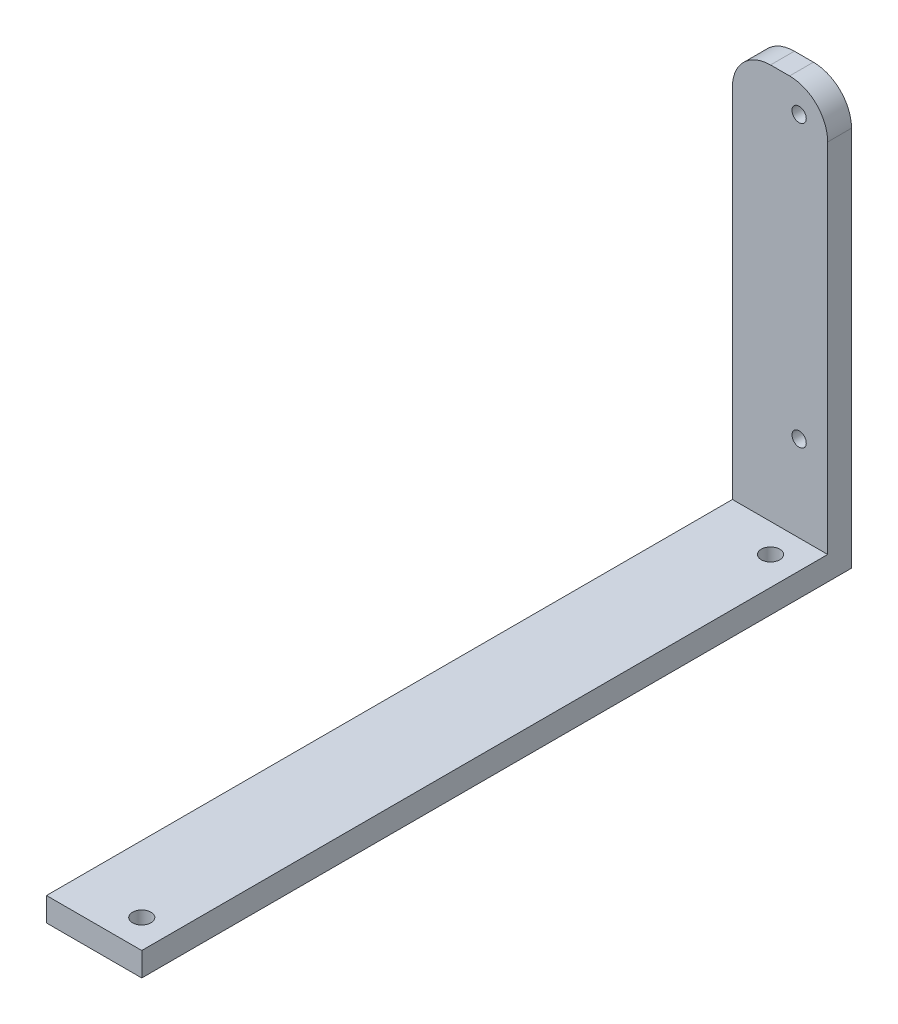
ISO-10303-21;
HEADER;
FILE_DESCRIPTION(('STEP AP214'),'2;1');
FILE_NAME('part.step','',(''),(''),'','','');
FILE_SCHEMA(('AUTOMOTIVE_DESIGN { 1 0 10303 214 1 1 1 1 }'));
ENDSEC;
DATA;
#1=APPLICATION_CONTEXT('core data for automotive mechanical design processes');
#2=APPLICATION_PROTOCOL_DEFINITION('international standard','automotive_design',2000,#1);
#3=PRODUCT_CONTEXT('',#1,'mechanical');
#4=PRODUCT('Part','Part','',(#3));
#5=PRODUCT_RELATED_PRODUCT_CATEGORY('part','',(#4));
#6=PRODUCT_DEFINITION_FORMATION('','',#4);
#7=PRODUCT_DEFINITION_CONTEXT('part definition',#1,'design');
#8=PRODUCT_DEFINITION('design','',#6,#7);
#9=PRODUCT_DEFINITION_SHAPE('','',#8);
#10=(LENGTH_UNIT() NAMED_UNIT(*) SI_UNIT(.MILLI.,.METRE.));
#11=(NAMED_UNIT(*) PLANE_ANGLE_UNIT() SI_UNIT($,.RADIAN.));
#12=(NAMED_UNIT(*) SI_UNIT($,.STERADIAN.) SOLID_ANGLE_UNIT());
#13=UNCERTAINTY_MEASURE_WITH_UNIT(LENGTH_MEASURE(1.E-05),#10,'distance_accuracy_value','');
#14=(GEOMETRIC_REPRESENTATION_CONTEXT(3) GLOBAL_UNCERTAINTY_ASSIGNED_CONTEXT((#13)) GLOBAL_UNIT_ASSIGNED_CONTEXT((#10,
#11,#12)) REPRESENTATION_CONTEXT('',''));
#15=CARTESIAN_POINT('',(0.,0.,0.));
#16=DIRECTION('',(0.,0.,1.));
#17=DIRECTION('',(1.,0.,0.));
#18=AXIS2_PLACEMENT_3D('',#15,#16,#17);
#19=CARTESIAN_POINT('',(0.,0.,5.));
#20=DIRECTION('',(0.,0.,-1.));
#21=DIRECTION('',(-1.,0.,0.));
#22=AXIS2_PLACEMENT_3D('',#19,#20,#21);
#23=PLANE('',#22);
#24=CARTESIAN_POINT('',(14.,23.,5.));
#25=DIRECTION('',(0.,0.,1.));
#26=DIRECTION('',(1.,0.,0.));
#27=AXIS2_PLACEMENT_3D('',#24,#25,#26);
#28=CIRCLE('',#27,1.5);
#29=CARTESIAN_POINT('',(15.5,23.,5.));
#30=VERTEX_POINT('',#29);
#31=EDGE_CURVE('E140',#30,#30,#28,.T.);
#32=ORIENTED_EDGE('',*,*,#31,.F.);
#33=EDGE_LOOP('',(#32));
#34=FACE_BOUND('',#33,.T.);
#35=CARTESIAN_POINT('',(14.,82.,5.));
#36=DIRECTION('',(0.,0.,1.));
#37=DIRECTION('',(1.,0.,0.));
#38=AXIS2_PLACEMENT_3D('',#35,#36,#37);
#39=CIRCLE('',#38,1.5);
#40=CARTESIAN_POINT('',(15.5,82.,5.));
#41=VERTEX_POINT('',#40);
#42=EDGE_CURVE('E178',#41,#41,#39,.T.);
#43=ORIENTED_EDGE('',*,*,#42,.F.);
#44=EDGE_LOOP('',(#43));
#45=FACE_BOUND('',#44,.T.);
#46=DIRECTION('',(0.,1.,0.));
#47=VECTOR('',#46,1.);
#48=CARTESIAN_POINT('',(20.,0.,5.));
#49=LINE('',#48,#47);
#50=CARTESIAN_POINT('',(20.,5.,5.));
#51=VERTEX_POINT('',#50);
#52=CARTESIAN_POINT('',(20.,80.,5.));
#53=VERTEX_POINT('',#52);
#54=EDGE_CURVE('E144',#51,#53,#49,.T.);
#55=ORIENTED_EDGE('',*,*,#54,.T.);
#56=CARTESIAN_POINT('',(12.,80.,5.));
#57=DIRECTION('',(0.,0.,-1.));
#58=DIRECTION('',(-1.,0.,0.));
#59=AXIS2_PLACEMENT_3D('',#56,#57,#58);
#60=CIRCLE('',#59,8.);
#61=CARTESIAN_POINT('',(12.,88.,5.));
#62=VERTEX_POINT('',#61);
#63=EDGE_CURVE('E41',#53,#62,#60,.F.);
#64=ORIENTED_EDGE('',*,*,#63,.T.);
#65=DIRECTION('',(-1.,0.,0.));
#66=VECTOR('',#65,1.);
#67=CARTESIAN_POINT('',(0.,88.,5.));
#68=LINE('',#67,#66);
#69=CARTESIAN_POINT('',(8.,88.,5.));
#70=VERTEX_POINT('',#69);
#71=EDGE_CURVE('E174',#62,#70,#68,.T.);
#72=ORIENTED_EDGE('',*,*,#71,.T.);
#73=CARTESIAN_POINT('',(8.,80.,5.));
#74=DIRECTION('',(0.,0.,-1.));
#75=DIRECTION('',(-1.,0.,0.));
#76=AXIS2_PLACEMENT_3D('',#73,#74,#75);
#77=CIRCLE('',#76,8.);
#78=CARTESIAN_POINT('',(0.,80.,5.));
#79=VERTEX_POINT('',#78);
#80=EDGE_CURVE('E48',#70,#79,#77,.F.);
#81=ORIENTED_EDGE('',*,*,#80,.T.);
#82=DIRECTION('',(0.,-1.,0.));
#83=VECTOR('',#82,1.);
#84=CARTESIAN_POINT('',(0.,0.,5.));
#85=LINE('',#84,#83);
#86=CARTESIAN_POINT('',(0.,5.,5.));
#87=VERTEX_POINT('',#86);
#88=EDGE_CURVE('E164',#79,#87,#85,.T.);
#89=ORIENTED_EDGE('',*,*,#88,.T.);
#90=DIRECTION('',(-1.,0.,0.));
#91=VECTOR('',#90,1.);
#92=CARTESIAN_POINT('',(0.,5.,5.));
#93=LINE('',#92,#91);
#94=EDGE_CURVE('E126',#51,#87,#93,.T.);
#95=ORIENTED_EDGE('',*,*,#94,.F.);
#96=EDGE_LOOP('',(#55,#64,#72,#81,#89,#95));
#97=FACE_BOUND('',#96,.T.);
#98=ADVANCED_FACE('F33',(#34,#45,#97),#23,.F.);
#99=CARTESIAN_POINT('',(0.,0.,0.));
#100=DIRECTION('',(0.,0.,-1.));
#101=DIRECTION('',(-1.,0.,0.));
#102=AXIS2_PLACEMENT_3D('',#99,#100,#101);
#103=PLANE('',#102);
#104=CARTESIAN_POINT('',(14.,82.,0.));
#105=DIRECTION('',(0.,0.,1.));
#106=DIRECTION('',(1.,0.,0.));
#107=AXIS2_PLACEMENT_3D('',#104,#105,#106);
#108=CIRCLE('',#107,1.5);
#109=CARTESIAN_POINT('',(15.5,82.,0.));
#110=VERTEX_POINT('',#109);
#111=EDGE_CURVE('E170',#110,#110,#108,.T.);
#112=ORIENTED_EDGE('',*,*,#111,.T.);
#113=EDGE_LOOP('',(#112));
#114=FACE_BOUND('',#113,.T.);
#115=DIRECTION('',(-1.,0.,0.));
#116=VECTOR('',#115,1.);
#117=CARTESIAN_POINT('',(0.,88.,0.));
#118=LINE('',#117,#116);
#119=CARTESIAN_POINT('',(12.,88.,0.));
#120=VERTEX_POINT('',#119);
#121=CARTESIAN_POINT('',(8.,88.,0.));
#122=VERTEX_POINT('',#121);
#123=EDGE_CURVE('E167',#120,#122,#118,.T.);
#124=ORIENTED_EDGE('',*,*,#123,.F.);
#125=CARTESIAN_POINT('',(12.,80.,0.));
#126=DIRECTION('',(0.,0.,-1.));
#127=DIRECTION('',(-1.,0.,0.));
#128=AXIS2_PLACEMENT_3D('',#125,#126,#127);
#129=CIRCLE('',#128,8.);
#130=CARTESIAN_POINT('',(20.,80.,0.));
#131=VERTEX_POINT('',#130);
#132=EDGE_CURVE('E161',#120,#131,#129,.T.);
#133=ORIENTED_EDGE('',*,*,#132,.T.);
#134=DIRECTION('',(0.,1.,0.));
#135=VECTOR('',#134,1.);
#136=CARTESIAN_POINT('',(20.,0.,0.));
#137=LINE('',#136,#135);
#138=CARTESIAN_POINT('',(20.,0.,0.));
#139=VERTEX_POINT('',#138);
#140=EDGE_CURVE('E180',#139,#131,#137,.T.);
#141=ORIENTED_EDGE('',*,*,#140,.F.);
#142=DIRECTION('',(1.,0.,0.));
#143=VECTOR('',#142,1.);
#144=CARTESIAN_POINT('',(0.,0.,0.));
#145=LINE('',#144,#143);
#146=CARTESIAN_POINT('',(0.,0.,0.));
#147=VERTEX_POINT('',#146);
#148=EDGE_CURVE('E177',#147,#139,#145,.T.);
#149=ORIENTED_EDGE('',*,*,#148,.F.);
#150=DIRECTION('',(0.,-1.,0.));
#151=VECTOR('',#150,1.);
#152=CARTESIAN_POINT('',(0.,0.,0.));
#153=LINE('',#152,#151);
#154=CARTESIAN_POINT('',(0.,80.,0.));
#155=VERTEX_POINT('',#154);
#156=EDGE_CURVE('E108',#155,#147,#153,.T.);
#157=ORIENTED_EDGE('',*,*,#156,.F.);
#158=CARTESIAN_POINT('',(8.,80.,0.));
#159=DIRECTION('',(0.,0.,-1.));
#160=DIRECTION('',(-1.,0.,0.));
#161=AXIS2_PLACEMENT_3D('',#158,#159,#160);
#162=CIRCLE('',#161,8.);
#163=EDGE_CURVE('E159',#155,#122,#162,.T.);
#164=ORIENTED_EDGE('',*,*,#163,.T.);
#165=EDGE_LOOP('',(#124,#133,#141,#149,#157,#164));
#166=FACE_BOUND('',#165,.T.);
#167=CARTESIAN_POINT('',(14.,23.,0.));
#168=DIRECTION('',(0.,0.,1.));
#169=DIRECTION('',(1.,0.,0.));
#170=AXIS2_PLACEMENT_3D('',#167,#168,#169);
#171=CIRCLE('',#170,1.5);
#172=CARTESIAN_POINT('',(15.5,23.,0.));
#173=VERTEX_POINT('',#172);
#174=EDGE_CURVE('E152',#173,#173,#171,.T.);
#175=ORIENTED_EDGE('',*,*,#174,.T.);
#176=EDGE_LOOP('',(#175));
#177=FACE_BOUND('',#176,.T.);
#178=ADVANCED_FACE('F189',(#114,#166,#177),#103,.T.);
#179=CARTESIAN_POINT('',(0.,0.,5.));
#180=DIRECTION('',(1.,0.,0.));
#181=DIRECTION('',(0.,0.,-1.));
#182=AXIS2_PLACEMENT_3D('',#179,#180,#181);
#183=PLANE('',#182);
#184=ORIENTED_EDGE('',*,*,#88,.F.);
#185=DIRECTION('',(0.,0.,-1.));
#186=VECTOR('',#185,1.);
#187=CARTESIAN_POINT('',(0.,80.,5.));
#188=LINE('',#187,#186);
#189=EDGE_CURVE('E11',#79,#155,#188,.T.);
#190=ORIENTED_EDGE('',*,*,#189,.T.);
#191=ORIENTED_EDGE('',*,*,#156,.T.);
#192=DIRECTION('',(0.,0.,-1.));
#193=VECTOR('',#192,1.);
#194=CARTESIAN_POINT('',(0.,0.,5.));
#195=LINE('',#194,#193);
#196=CARTESIAN_POINT('',(0.,0.,149.));
#197=VERTEX_POINT('',#196);
#198=EDGE_CURVE('E101',#197,#147,#195,.T.);
#199=ORIENTED_EDGE('',*,*,#198,.F.);
#200=DIRECTION('',(0.,-1.,0.));
#201=VECTOR('',#200,1.);
#202=CARTESIAN_POINT('',(0.,0.,149.));
#203=LINE('',#202,#201);
#204=CARTESIAN_POINT('',(0.,5.,149.));
#205=VERTEX_POINT('',#204);
#206=EDGE_CURVE('E106',#205,#197,#203,.T.);
#207=ORIENTED_EDGE('',*,*,#206,.F.);
#208=DIRECTION('',(0.,0.,-1.));
#209=VECTOR('',#208,1.);
#210=CARTESIAN_POINT('',(0.,5.,149.));
#211=LINE('',#210,#209);
#212=EDGE_CURVE('E137',#205,#87,#211,.T.);
#213=ORIENTED_EDGE('',*,*,#212,.T.);
#214=EDGE_LOOP('',(#184,#190,#191,#199,#207,#213));
#215=FACE_BOUND('',#214,.T.);
#216=ADVANCED_FACE('F103',(#215),#183,.F.);
#217=CARTESIAN_POINT('',(0.,0.,5.));
#218=DIRECTION('',(0.,1.,0.));
#219=DIRECTION('',(0.,0.,1.));
#220=AXIS2_PLACEMENT_3D('',#217,#218,#219);
#221=PLANE('',#220);
#222=CARTESIAN_POINT('',(14.,0.,11.));
#223=DIRECTION('',(0.,1.,0.));
#224=DIRECTION('',(0.,0.,1.));
#225=AXIS2_PLACEMENT_3D('',#222,#223,#224);
#226=CIRCLE('',#225,1.93940069822841);
#227=CARTESIAN_POINT('',(14.,0.,12.9394006982284));
#228=VERTEX_POINT('',#227);
#229=EDGE_CURVE('E258',#228,#228,#226,.T.);
#230=ORIENTED_EDGE('',*,*,#229,.T.);
#231=EDGE_LOOP('',(#230));
#232=FACE_BOUND('',#231,.T.);
#233=CARTESIAN_POINT('',(14.,0.,143.));
#234=DIRECTION('',(0.,1.,0.));
#235=DIRECTION('',(0.,0.,1.));
#236=AXIS2_PLACEMENT_3D('',#233,#234,#235);
#237=CIRCLE('',#236,1.9394006982284);
#238=CARTESIAN_POINT('',(14.,0.,144.939400698228));
#239=VERTEX_POINT('',#238);
#240=EDGE_CURVE('E129',#239,#239,#237,.T.);
#241=ORIENTED_EDGE('',*,*,#240,.T.);
#242=EDGE_LOOP('',(#241));
#243=FACE_BOUND('',#242,.T.);
#244=ORIENTED_EDGE('',*,*,#148,.T.);
#245=DIRECTION('',(0.,0.,-1.));
#246=VECTOR('',#245,1.);
#247=CARTESIAN_POINT('',(20.,0.,5.));
#248=LINE('',#247,#246);
#249=CARTESIAN_POINT('',(20.,0.,149.));
#250=VERTEX_POINT('',#249);
#251=EDGE_CURVE('E112',#250,#139,#248,.T.);
#252=ORIENTED_EDGE('',*,*,#251,.F.);
#253=DIRECTION('',(1.,0.,0.));
#254=VECTOR('',#253,1.);
#255=CARTESIAN_POINT('',(0.,0.,149.));
#256=LINE('',#255,#254);
#257=EDGE_CURVE('E115',#197,#250,#256,.T.);
#258=ORIENTED_EDGE('',*,*,#257,.F.);
#259=ORIENTED_EDGE('',*,*,#198,.T.);
#260=EDGE_LOOP('',(#244,#252,#258,#259));
#261=FACE_BOUND('',#260,.T.);
#262=ADVANCED_FACE('F116',(#232,#243,#261),#221,.F.);
#263=CARTESIAN_POINT('',(20.,0.,5.));
#264=DIRECTION('',(-1.,0.,0.));
#265=DIRECTION('',(0.,0.,1.));
#266=AXIS2_PLACEMENT_3D('',#263,#264,#265);
#267=PLANE('',#266);
#268=ORIENTED_EDGE('',*,*,#140,.T.);
#269=DIRECTION('',(0.,0.,-1.));
#270=VECTOR('',#269,1.);
#271=CARTESIAN_POINT('',(20.,80.,5.));
#272=LINE('',#271,#270);
#273=EDGE_CURVE('E56',#131,#53,#272,.F.);
#274=ORIENTED_EDGE('',*,*,#273,.T.);
#275=ORIENTED_EDGE('',*,*,#54,.F.);
#276=DIRECTION('',(0.,0.,-1.));
#277=VECTOR('',#276,1.);
#278=CARTESIAN_POINT('',(20.,5.,149.));
#279=LINE('',#278,#277);
#280=CARTESIAN_POINT('',(20.,5.,149.));
#281=VERTEX_POINT('',#280);
#282=EDGE_CURVE('E147',#281,#51,#279,.T.);
#283=ORIENTED_EDGE('',*,*,#282,.F.);
#284=DIRECTION('',(0.,1.,0.));
#285=VECTOR('',#284,1.);
#286=CARTESIAN_POINT('',(20.,0.,149.));
#287=LINE('',#286,#285);
#288=EDGE_CURVE('E120',#250,#281,#287,.T.);
#289=ORIENTED_EDGE('',*,*,#288,.F.);
#290=ORIENTED_EDGE('',*,*,#251,.T.);
#291=EDGE_LOOP('',(#268,#274,#275,#283,#289,#290));
#292=FACE_BOUND('',#291,.T.);
#293=ADVANCED_FACE('F185',(#292),#267,.F.);
#294=CARTESIAN_POINT('',(0.,88.,5.));
#295=DIRECTION('',(0.,-1.,0.));
#296=DIRECTION('',(0.,0.,-1.));
#297=AXIS2_PLACEMENT_3D('',#294,#295,#296);
#298=PLANE('',#297);
#299=ORIENTED_EDGE('',*,*,#71,.F.);
#300=DIRECTION('',(0.,0.,-1.));
#301=VECTOR('',#300,1.);
#302=CARTESIAN_POINT('',(12.,88.,5.));
#303=LINE('',#302,#301);
#304=EDGE_CURVE('E156',#62,#120,#303,.T.);
#305=ORIENTED_EDGE('',*,*,#304,.T.);
#306=ORIENTED_EDGE('',*,*,#123,.T.);
#307=DIRECTION('',(0.,0.,-1.));
#308=VECTOR('',#307,1.);
#309=CARTESIAN_POINT('',(8.,88.,5.));
#310=LINE('',#309,#308);
#311=EDGE_CURVE('E111',#122,#70,#310,.F.);
#312=ORIENTED_EDGE('',*,*,#311,.T.);
#313=EDGE_LOOP('',(#299,#305,#306,#312));
#314=FACE_BOUND('',#313,.T.);
#315=ADVANCED_FACE('F197',(#314),#298,.F.);
#316=CARTESIAN_POINT('',(14.,82.,5.));
#317=DIRECTION('',(0.,0.,-1.));
#318=DIRECTION('',(-1.,0.,0.));
#319=AXIS2_PLACEMENT_3D('',#316,#317,#318);
#320=CYLINDRICAL_SURFACE('',#319,1.5);
#321=ORIENTED_EDGE('',*,*,#42,.T.);
#322=EDGE_LOOP('',(#321));
#323=FACE_BOUND('',#322,.T.);
#324=ORIENTED_EDGE('',*,*,#111,.F.);
#325=EDGE_LOOP('',(#324));
#326=FACE_BOUND('',#325,.T.);
#327=ADVANCED_FACE('F212',(#323,#326),#320,.F.);
#328=CARTESIAN_POINT('',(14.,23.,5.));
#329=DIRECTION('',(0.,0.,-1.));
#330=DIRECTION('',(-1.,0.,0.));
#331=AXIS2_PLACEMENT_3D('',#328,#329,#330);
#332=CYLINDRICAL_SURFACE('',#331,1.5);
#333=ORIENTED_EDGE('',*,*,#31,.T.);
#334=EDGE_LOOP('',(#333));
#335=FACE_BOUND('',#334,.T.);
#336=ORIENTED_EDGE('',*,*,#174,.F.);
#337=EDGE_LOOP('',(#336));
#338=FACE_BOUND('',#337,.T.);
#339=ADVANCED_FACE('F204',(#335,#338),#332,.F.);
#340=CARTESIAN_POINT('',(0.,5.,149.));
#341=DIRECTION('',(0.,-1.,0.));
#342=DIRECTION('',(0.,0.,-1.));
#343=AXIS2_PLACEMENT_3D('',#340,#341,#342);
#344=PLANE('',#343);
#345=CARTESIAN_POINT('',(14.,5.,11.));
#346=DIRECTION('',(0.,1.,0.));
#347=DIRECTION('',(0.,0.,1.));
#348=AXIS2_PLACEMENT_3D('',#345,#346,#347);
#349=CIRCLE('',#348,1.93940069822841);
#350=CARTESIAN_POINT('',(14.,5.,12.9394006982284));
#351=VERTEX_POINT('',#350);
#352=EDGE_CURVE('E260',#351,#351,#349,.T.);
#353=ORIENTED_EDGE('',*,*,#352,.F.);
#354=EDGE_LOOP('',(#353));
#355=FACE_BOUND('',#354,.T.);
#356=CARTESIAN_POINT('',(14.,5.,143.));
#357=DIRECTION('',(0.,1.,0.));
#358=DIRECTION('',(0.,0.,1.));
#359=AXIS2_PLACEMENT_3D('',#356,#357,#358);
#360=CIRCLE('',#359,1.9394006982284);
#361=CARTESIAN_POINT('',(14.,5.,144.939400698228));
#362=VERTEX_POINT('',#361);
#363=EDGE_CURVE('E132',#362,#362,#360,.T.);
#364=ORIENTED_EDGE('',*,*,#363,.F.);
#365=EDGE_LOOP('',(#364));
#366=FACE_BOUND('',#365,.T.);
#367=ORIENTED_EDGE('',*,*,#94,.T.);
#368=ORIENTED_EDGE('',*,*,#212,.F.);
#369=DIRECTION('',(-1.,0.,0.));
#370=VECTOR('',#369,1.);
#371=CARTESIAN_POINT('',(0.,5.,149.));
#372=LINE('',#371,#370);
#373=EDGE_CURVE('E124',#281,#205,#372,.T.);
#374=ORIENTED_EDGE('',*,*,#373,.F.);
#375=ORIENTED_EDGE('',*,*,#282,.T.);
#376=EDGE_LOOP('',(#367,#368,#374,#375));
#377=FACE_BOUND('',#376,.T.);
#378=ADVANCED_FACE('F202',(#355,#366,#377),#344,.F.);
#379=CARTESIAN_POINT('',(0.,0.,149.));
#380=DIRECTION('',(0.,0.,-1.));
#381=DIRECTION('',(-1.,0.,0.));
#382=AXIS2_PLACEMENT_3D('',#379,#380,#381);
#383=PLANE('',#382);
#384=ORIENTED_EDGE('',*,*,#206,.T.);
#385=ORIENTED_EDGE('',*,*,#257,.T.);
#386=ORIENTED_EDGE('',*,*,#288,.T.);
#387=ORIENTED_EDGE('',*,*,#373,.T.);
#388=EDGE_LOOP('',(#384,#385,#386,#387));
#389=FACE_BOUND('',#388,.T.);
#390=ADVANCED_FACE('F122',(#389),#383,.F.);
#391=CARTESIAN_POINT('',(12.,80.,5.));
#392=DIRECTION('',(0.,0.,-1.));
#393=DIRECTION('',(-1.,0.,0.));
#394=AXIS2_PLACEMENT_3D('',#391,#392,#393);
#395=CYLINDRICAL_SURFACE('',#394,8.);
#396=ORIENTED_EDGE('',*,*,#63,.F.);
#397=ORIENTED_EDGE('',*,*,#273,.F.);
#398=ORIENTED_EDGE('',*,*,#132,.F.);
#399=ORIENTED_EDGE('',*,*,#304,.F.);
#400=EDGE_LOOP('',(#396,#397,#398,#399));
#401=FACE_BOUND('',#400,.T.);
#402=ADVANCED_FACE('F194',(#401),#395,.T.);
#403=CARTESIAN_POINT('',(8.,80.,5.));
#404=DIRECTION('',(0.,0.,-1.));
#405=DIRECTION('',(-1.,0.,0.));
#406=AXIS2_PLACEMENT_3D('',#403,#404,#405);
#407=CYLINDRICAL_SURFACE('',#406,8.);
#408=ORIENTED_EDGE('',*,*,#80,.F.);
#409=ORIENTED_EDGE('',*,*,#311,.F.);
#410=ORIENTED_EDGE('',*,*,#163,.F.);
#411=ORIENTED_EDGE('',*,*,#189,.F.);
#412=EDGE_LOOP('',(#408,#409,#410,#411));
#413=FACE_BOUND('',#412,.T.);
#414=ADVANCED_FACE('F35',(#413),#407,.T.);
#415=CARTESIAN_POINT('',(14.,0.,143.));
#416=DIRECTION('',(0.,1.,0.));
#417=DIRECTION('',(0.,0.,1.));
#418=AXIS2_PLACEMENT_3D('',#415,#416,#417);
#419=CYLINDRICAL_SURFACE('',#418,1.9394006982284);
#420=ORIENTED_EDGE('',*,*,#240,.F.);
#421=EDGE_LOOP('',(#420));
#422=FACE_BOUND('',#421,.T.);
#423=ORIENTED_EDGE('',*,*,#363,.T.);
#424=EDGE_LOOP('',(#423));
#425=FACE_BOUND('',#424,.T.);
#426=ADVANCED_FACE('F241',(#422,#425),#419,.F.);
#427=CARTESIAN_POINT('',(14.,0.,11.));
#428=DIRECTION('',(0.,1.,0.));
#429=DIRECTION('',(0.,0.,1.));
#430=AXIS2_PLACEMENT_3D('',#427,#428,#429);
#431=CYLINDRICAL_SURFACE('',#430,1.93940069822841);
#432=ORIENTED_EDGE('',*,*,#229,.F.);
#433=EDGE_LOOP('',(#432));
#434=FACE_BOUND('',#433,.T.);
#435=ORIENTED_EDGE('',*,*,#352,.T.);
#436=EDGE_LOOP('',(#435));
#437=FACE_BOUND('',#436,.T.);
#438=ADVANCED_FACE('F245',(#434,#437),#431,.F.);
#439=CLOSED_SHELL('',(#98,#178,#216,#262,#293,#315,#327,#339,#378,#390,#402,#414,#426,#438));
#440=MANIFOLD_SOLID_BREP('B2',#439);
#441=ADVANCED_BREP_SHAPE_REPRESENTATION('',(#18,#440),#14);
#442=SHAPE_DEFINITION_REPRESENTATION(#9,#441);
ENDSEC;
END-ISO-10303-21;
